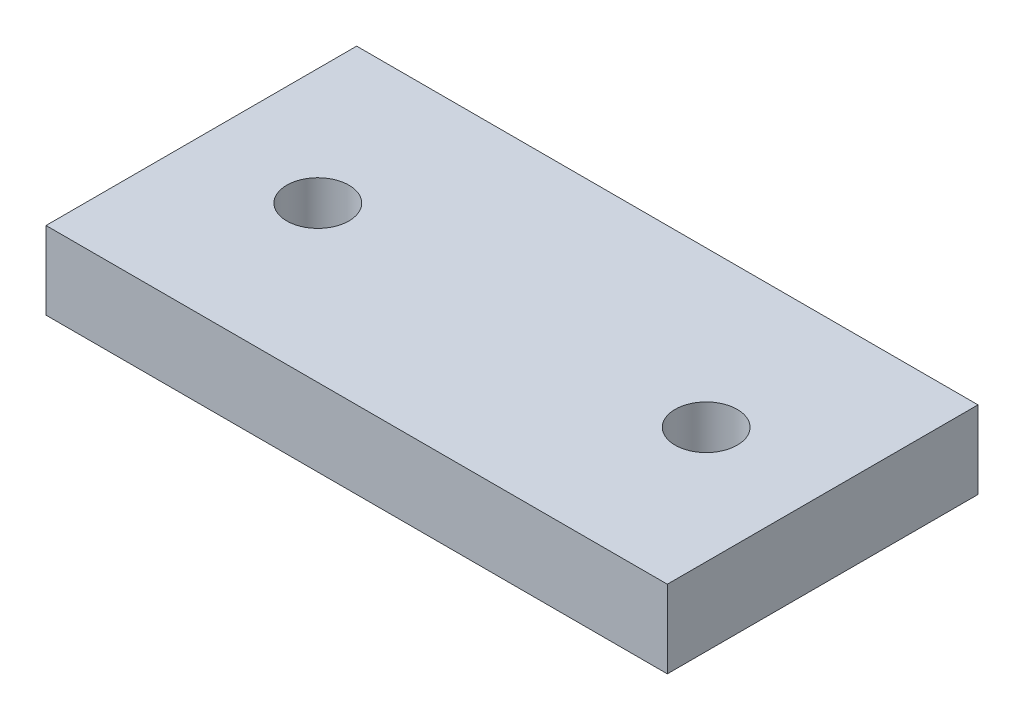
ISO-10303-21;
HEADER;
FILE_DESCRIPTION(('STEP AP214'),'2;1');
FILE_NAME('part.step','',(''),(''),'','','');
FILE_SCHEMA(('AUTOMOTIVE_DESIGN { 1 0 10303 214 1 1 1 1 }'));
ENDSEC;
DATA;
#1=APPLICATION_CONTEXT('core data for automotive mechanical design processes');
#2=APPLICATION_PROTOCOL_DEFINITION('international standard','automotive_design',2000,#1);
#3=PRODUCT_CONTEXT('',#1,'mechanical');
#4=PRODUCT('Part','Part','',(#3));
#5=PRODUCT_RELATED_PRODUCT_CATEGORY('part','',(#4));
#6=PRODUCT_DEFINITION_FORMATION('','',#4);
#7=PRODUCT_DEFINITION_CONTEXT('part definition',#1,'design');
#8=PRODUCT_DEFINITION('design','',#6,#7);
#9=PRODUCT_DEFINITION_SHAPE('','',#8);
#10=(LENGTH_UNIT() NAMED_UNIT(*) SI_UNIT(.MILLI.,.METRE.));
#11=(NAMED_UNIT(*) PLANE_ANGLE_UNIT() SI_UNIT($,.RADIAN.));
#12=(NAMED_UNIT(*) SI_UNIT($,.STERADIAN.) SOLID_ANGLE_UNIT());
#13=UNCERTAINTY_MEASURE_WITH_UNIT(LENGTH_MEASURE(1.E-05),#10,'distance_accuracy_value','');
#14=(GEOMETRIC_REPRESENTATION_CONTEXT(3) GLOBAL_UNCERTAINTY_ASSIGNED_CONTEXT((#13)) GLOBAL_UNIT_ASSIGNED_CONTEXT((#10,
#11,#12)) REPRESENTATION_CONTEXT('',''));
#15=CARTESIAN_POINT('',(0.,0.,0.));
#16=DIRECTION('',(0.,0.,1.));
#17=DIRECTION('',(1.,0.,0.));
#18=AXIS2_PLACEMENT_3D('',#15,#16,#17);
#19=CARTESIAN_POINT('',(-20.,5.,10.));
#20=DIRECTION('',(-1.,0.,0.));
#21=DIRECTION('',(0.,0.,1.));
#22=AXIS2_PLACEMENT_3D('',#19,#20,#21);
#23=PLANE('',#22);
#24=DIRECTION('',(0.,0.,-1.));
#25=VECTOR('',#24,1.);
#26=CARTESIAN_POINT('',(-20.,0.,10.));
#27=LINE('',#26,#25);
#28=CARTESIAN_POINT('',(-20.,0.,10.));
#29=VERTEX_POINT('',#28);
#30=CARTESIAN_POINT('',(-20.,0.,-10.));
#31=VERTEX_POINT('',#30);
#32=EDGE_CURVE('E111',#29,#31,#27,.T.);
#33=ORIENTED_EDGE('',*,*,#32,.F.);
#34=DIRECTION('',(0.,-1.,0.));
#35=VECTOR('',#34,1.);
#36=CARTESIAN_POINT('',(-20.,5.,10.));
#37=LINE('',#36,#35);
#38=CARTESIAN_POINT('',(-20.,5.,10.));
#39=VERTEX_POINT('',#38);
#40=EDGE_CURVE('E11',#39,#29,#37,.T.);
#41=ORIENTED_EDGE('',*,*,#40,.F.);
#42=DIRECTION('',(0.,0.,-1.));
#43=VECTOR('',#42,1.);
#44=CARTESIAN_POINT('',(-20.,5.,10.));
#45=LINE('',#44,#43);
#46=CARTESIAN_POINT('',(-20.,5.,-10.));
#47=VERTEX_POINT('',#46);
#48=EDGE_CURVE('E103',#39,#47,#45,.T.);
#49=ORIENTED_EDGE('',*,*,#48,.T.);
#50=DIRECTION('',(0.,-1.,0.));
#51=VECTOR('',#50,1.);
#52=CARTESIAN_POINT('',(-20.,5.,-10.));
#53=LINE('',#52,#51);
#54=EDGE_CURVE('E42',#47,#31,#53,.T.);
#55=ORIENTED_EDGE('',*,*,#54,.T.);
#56=EDGE_LOOP('',(#33,#41,#49,#55));
#57=FACE_BOUND('',#56,.T.);
#58=ADVANCED_FACE('F39',(#57),#23,.T.);
#59=CARTESIAN_POINT('',(-20.,5.,10.));
#60=DIRECTION('',(0.,0.,-1.));
#61=DIRECTION('',(-1.,0.,0.));
#62=AXIS2_PLACEMENT_3D('',#59,#60,#61);
#63=PLANE('',#62);
#64=DIRECTION('',(1.,0.,0.));
#65=VECTOR('',#64,1.);
#66=CARTESIAN_POINT('',(-20.,0.,10.));
#67=LINE('',#66,#65);
#68=CARTESIAN_POINT('',(20.,0.,10.));
#69=VERTEX_POINT('',#68);
#70=EDGE_CURVE('E73',#29,#69,#67,.T.);
#71=ORIENTED_EDGE('',*,*,#70,.T.);
#72=DIRECTION('',(0.,-1.,0.));
#73=VECTOR('',#72,1.);
#74=CARTESIAN_POINT('',(20.,5.,10.));
#75=LINE('',#74,#73);
#76=CARTESIAN_POINT('',(20.,5.,10.));
#77=VERTEX_POINT('',#76);
#78=EDGE_CURVE('E49',#77,#69,#75,.T.);
#79=ORIENTED_EDGE('',*,*,#78,.F.);
#80=DIRECTION('',(1.,0.,0.));
#81=VECTOR('',#80,1.);
#82=CARTESIAN_POINT('',(-20.,5.,10.));
#83=LINE('',#82,#81);
#84=EDGE_CURVE('E90',#39,#77,#83,.T.);
#85=ORIENTED_EDGE('',*,*,#84,.F.);
#86=ORIENTED_EDGE('',*,*,#40,.T.);
#87=EDGE_LOOP('',(#71,#79,#85,#86));
#88=FACE_BOUND('',#87,.T.);
#89=ADVANCED_FACE('F128',(#88),#63,.F.);
#90=CARTESIAN_POINT('',(20.,5.,10.));
#91=DIRECTION('',(-1.,0.,0.));
#92=DIRECTION('',(0.,0.,1.));
#93=AXIS2_PLACEMENT_3D('',#90,#91,#92);
#94=PLANE('',#93);
#95=DIRECTION('',(0.,0.,-1.));
#96=VECTOR('',#95,1.);
#97=CARTESIAN_POINT('',(20.,0.,10.));
#98=LINE('',#97,#96);
#99=CARTESIAN_POINT('',(20.,0.,-10.));
#100=VERTEX_POINT('',#99);
#101=EDGE_CURVE('E98',#69,#100,#98,.T.);
#102=ORIENTED_EDGE('',*,*,#101,.T.);
#103=DIRECTION('',(0.,-1.,0.));
#104=VECTOR('',#103,1.);
#105=CARTESIAN_POINT('',(20.,5.,-10.));
#106=LINE('',#105,#104);
#107=CARTESIAN_POINT('',(20.,5.,-10.));
#108=VERTEX_POINT('',#107);
#109=EDGE_CURVE('E95',#108,#100,#106,.T.);
#110=ORIENTED_EDGE('',*,*,#109,.F.);
#111=DIRECTION('',(0.,0.,-1.));
#112=VECTOR('',#111,1.);
#113=CARTESIAN_POINT('',(20.,5.,10.));
#114=LINE('',#113,#112);
#115=EDGE_CURVE('E85',#77,#108,#114,.T.);
#116=ORIENTED_EDGE('',*,*,#115,.F.);
#117=ORIENTED_EDGE('',*,*,#78,.T.);
#118=EDGE_LOOP('',(#102,#110,#116,#117));
#119=FACE_BOUND('',#118,.T.);
#120=ADVANCED_FACE('F96',(#119),#94,.F.);
#121=CARTESIAN_POINT('',(-20.,5.,-10.));
#122=DIRECTION('',(0.,0.,-1.));
#123=DIRECTION('',(-1.,0.,0.));
#124=AXIS2_PLACEMENT_3D('',#121,#122,#123);
#125=PLANE('',#124);
#126=DIRECTION('',(1.,0.,0.));
#127=VECTOR('',#126,1.);
#128=CARTESIAN_POINT('',(-20.,0.,-10.));
#129=LINE('',#128,#127);
#130=EDGE_CURVE('E115',#31,#100,#129,.T.);
#131=ORIENTED_EDGE('',*,*,#130,.F.);
#132=ORIENTED_EDGE('',*,*,#54,.F.);
#133=DIRECTION('',(1.,0.,0.));
#134=VECTOR('',#133,1.);
#135=CARTESIAN_POINT('',(-20.,5.,-10.));
#136=LINE('',#135,#134);
#137=EDGE_CURVE('E89',#47,#108,#136,.T.);
#138=ORIENTED_EDGE('',*,*,#137,.T.);
#139=ORIENTED_EDGE('',*,*,#109,.T.);
#140=EDGE_LOOP('',(#131,#132,#138,#139));
#141=FACE_BOUND('',#140,.T.);
#142=ADVANCED_FACE('F101',(#141),#125,.T.);
#143=CARTESIAN_POINT('',(0.,5.,0.));
#144=DIRECTION('',(0.,-1.,0.));
#145=DIRECTION('',(0.,0.,-1.));
#146=AXIS2_PLACEMENT_3D('',#143,#144,#145);
#147=PLANE('',#146);
#148=CARTESIAN_POINT('',(12.5,5.,0.));
#149=DIRECTION('',(0.,1.,0.));
#150=DIRECTION('',(0.,0.,-1.));
#151=AXIS2_PLACEMENT_3D('',#148,#149,#150);
#152=CIRCLE('',#151,2.);
#153=CARTESIAN_POINT('',(12.5,5.,-2.));
#154=VERTEX_POINT('',#153);
#155=EDGE_CURVE('E164',#154,#154,#152,.T.);
#156=ORIENTED_EDGE('',*,*,#155,.F.);
#157=EDGE_LOOP('',(#156));
#158=FACE_BOUND('',#157,.T.);
#159=CARTESIAN_POINT('',(-12.5,5.,0.));
#160=DIRECTION('',(0.,1.,0.));
#161=DIRECTION('',(0.,0.,1.));
#162=AXIS2_PLACEMENT_3D('',#159,#160,#161);
#163=CIRCLE('',#162,2.);
#164=CARTESIAN_POINT('',(-12.5,5.,2.));
#165=VERTEX_POINT('',#164);
#166=EDGE_CURVE('E172',#165,#165,#163,.T.);
#167=ORIENTED_EDGE('',*,*,#166,.F.);
#168=EDGE_LOOP('',(#167));
#169=FACE_BOUND('',#168,.T.);
#170=ORIENTED_EDGE('',*,*,#48,.F.);
#171=ORIENTED_EDGE('',*,*,#84,.T.);
#172=ORIENTED_EDGE('',*,*,#115,.T.);
#173=ORIENTED_EDGE('',*,*,#137,.F.);
#174=EDGE_LOOP('',(#170,#171,#172,#173));
#175=FACE_BOUND('',#174,.T.);
#176=ADVANCED_FACE('F88',(#158,#169,#175),#147,.F.);
#177=CARTESIAN_POINT('',(0.,0.,0.));
#178=DIRECTION('',(0.,-1.,0.));
#179=DIRECTION('',(0.,0.,-1.));
#180=AXIS2_PLACEMENT_3D('',#177,#178,#179);
#181=PLANE('',#180);
#182=CARTESIAN_POINT('',(12.5,0.,0.));
#183=DIRECTION('',(0.,1.,0.));
#184=DIRECTION('',(0.,0.,-1.));
#185=AXIS2_PLACEMENT_3D('',#182,#183,#184);
#186=CIRCLE('',#185,2.);
#187=CARTESIAN_POINT('',(12.5,0.,-2.));
#188=VERTEX_POINT('',#187);
#189=EDGE_CURVE('E116',#188,#188,#186,.T.);
#190=ORIENTED_EDGE('',*,*,#189,.T.);
#191=EDGE_LOOP('',(#190));
#192=FACE_BOUND('',#191,.T.);
#193=CARTESIAN_POINT('',(-12.5,0.,0.));
#194=DIRECTION('',(0.,1.,0.));
#195=DIRECTION('',(0.,0.,1.));
#196=AXIS2_PLACEMENT_3D('',#193,#194,#195);
#197=CIRCLE('',#196,2.);
#198=CARTESIAN_POINT('',(-12.5,0.,2.));
#199=VERTEX_POINT('',#198);
#200=EDGE_CURVE('E166',#199,#199,#197,.T.);
#201=ORIENTED_EDGE('',*,*,#200,.T.);
#202=EDGE_LOOP('',(#201));
#203=FACE_BOUND('',#202,.T.);
#204=ORIENTED_EDGE('',*,*,#32,.T.);
#205=ORIENTED_EDGE('',*,*,#130,.T.);
#206=ORIENTED_EDGE('',*,*,#101,.F.);
#207=ORIENTED_EDGE('',*,*,#70,.F.);
#208=EDGE_LOOP('',(#204,#205,#206,#207));
#209=FACE_BOUND('',#208,.T.);
#210=ADVANCED_FACE('F125',(#192,#203,#209),#181,.T.);
#211=CARTESIAN_POINT('',(-12.5,0.,0.));
#212=DIRECTION('',(0.,1.,0.));
#213=DIRECTION('',(0.,0.,1.));
#214=AXIS2_PLACEMENT_3D('',#211,#212,#213);
#215=CYLINDRICAL_SURFACE('',#214,2.);
#216=ORIENTED_EDGE('',*,*,#200,.F.);
#217=EDGE_LOOP('',(#216));
#218=FACE_BOUND('',#217,.T.);
#219=ORIENTED_EDGE('',*,*,#166,.T.);
#220=EDGE_LOOP('',(#219));
#221=FACE_BOUND('',#220,.T.);
#222=ADVANCED_FACE('F147',(#218,#221),#215,.F.);
#223=CARTESIAN_POINT('',(12.5,0.,0.));
#224=DIRECTION('',(0.,1.,0.));
#225=DIRECTION('',(0.,0.,1.));
#226=AXIS2_PLACEMENT_3D('',#223,#224,#225);
#227=CYLINDRICAL_SURFACE('',#226,2.);
#228=ORIENTED_EDGE('',*,*,#189,.F.);
#229=EDGE_LOOP('',(#228));
#230=FACE_BOUND('',#229,.T.);
#231=ORIENTED_EDGE('',*,*,#155,.T.);
#232=EDGE_LOOP('',(#231));
#233=FACE_BOUND('',#232,.T.);
#234=ADVANCED_FACE('F154',(#230,#233),#227,.F.);
#235=CLOSED_SHELL('',(#58,#89,#120,#142,#176,#210,#222,#234));
#236=MANIFOLD_SOLID_BREP('B2',#235);
#237=ADVANCED_BREP_SHAPE_REPRESENTATION('',(#18,#236),#14);
#238=SHAPE_DEFINITION_REPRESENTATION(#9,#237);
ENDSEC;
END-ISO-10303-21;
